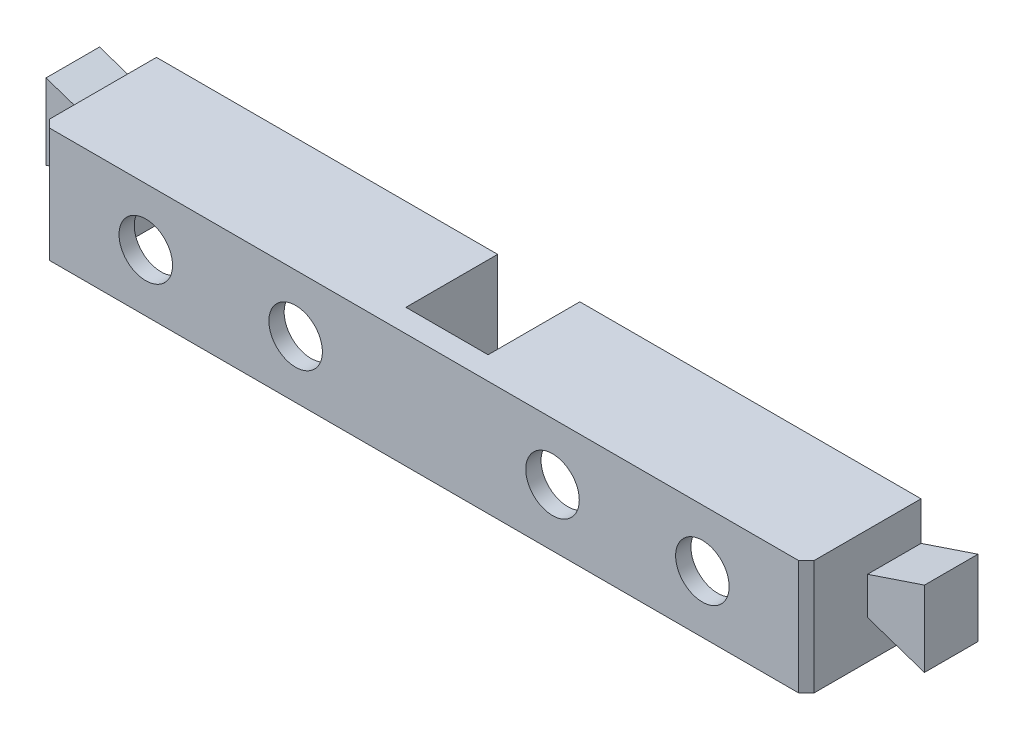
ISO-10303-21;
HEADER;
FILE_DESCRIPTION(('STEP AP214'),'2;1');
FILE_NAME('part.step','',(''),(''),'','','');
FILE_SCHEMA(('AUTOMOTIVE_DESIGN { 1 0 10303 214 1 1 1 1 }'));
ENDSEC;
DATA;
#1=APPLICATION_CONTEXT('core data for automotive mechanical design processes');
#2=APPLICATION_PROTOCOL_DEFINITION('international standard','automotive_design',2000,#1);
#3=PRODUCT_CONTEXT('',#1,'mechanical');
#4=PRODUCT('Part','Part','',(#3));
#5=PRODUCT_RELATED_PRODUCT_CATEGORY('part','',(#4));
#6=PRODUCT_DEFINITION_FORMATION('','',#4);
#7=PRODUCT_DEFINITION_CONTEXT('part definition',#1,'design');
#8=PRODUCT_DEFINITION('design','',#6,#7);
#9=PRODUCT_DEFINITION_SHAPE('','',#8);
#10=(LENGTH_UNIT() NAMED_UNIT(*) SI_UNIT(.MILLI.,.METRE.));
#11=(NAMED_UNIT(*) PLANE_ANGLE_UNIT() SI_UNIT($,.RADIAN.));
#12=(NAMED_UNIT(*) SI_UNIT($,.STERADIAN.) SOLID_ANGLE_UNIT());
#13=UNCERTAINTY_MEASURE_WITH_UNIT(LENGTH_MEASURE(1.E-05),#10,'distance_accuracy_value','');
#14=(GEOMETRIC_REPRESENTATION_CONTEXT(3) GLOBAL_UNCERTAINTY_ASSIGNED_CONTEXT((#13)) GLOBAL_UNIT_ASSIGNED_CONTEXT((#10,
#11,#12)) REPRESENTATION_CONTEXT('',''));
#15=CARTESIAN_POINT('',(0.,0.,0.));
#16=DIRECTION('',(0.,0.,1.));
#17=DIRECTION('',(1.,0.,0.));
#18=AXIS2_PLACEMENT_3D('',#15,#16,#17);
#19=CARTESIAN_POINT('',(-46.,5.5,13.));
#20=DIRECTION('',(0.,0.,1.));
#21=DIRECTION('',(1.,0.,0.));
#22=AXIS2_PLACEMENT_3D('',#19,#20,#21);
#23=PLANE('',#22);
#24=CARTESIAN_POINT('',(36.4,0.,13.));
#25=DIRECTION('',(0.,0.,1.));
#26=DIRECTION('',(1.,0.,0.));
#27=AXIS2_PLACEMENT_3D('',#24,#25,#26);
#28=CIRCLE('',#27,3.49999999999999);
#29=CARTESIAN_POINT('',(39.9,0.,13.));
#30=VERTEX_POINT('',#29);
#31=EDGE_CURVE('E356',#30,#30,#28,.T.);
#32=ORIENTED_EDGE('',*,*,#31,.T.);
#33=EDGE_LOOP('',(#32));
#34=FACE_BOUND('',#33,.T.);
#35=CARTESIAN_POINT('',(16.8,0.,13.));
#36=DIRECTION('',(0.,0.,1.));
#37=DIRECTION('',(1.,0.,0.));
#38=AXIS2_PLACEMENT_3D('',#35,#36,#37);
#39=CIRCLE('',#38,3.5);
#40=CARTESIAN_POINT('',(20.3,0.,13.));
#41=VERTEX_POINT('',#40);
#42=EDGE_CURVE('E525',#41,#41,#39,.T.);
#43=ORIENTED_EDGE('',*,*,#42,.T.);
#44=EDGE_LOOP('',(#43));
#45=FACE_BOUND('',#44,.T.);
#46=DIRECTION('',(0.,-1.,0.));
#47=VECTOR('',#46,1.);
#48=CARTESIAN_POINT('',(7.375,5.5,13.));
#49=LINE('',#48,#47);
#50=CARTESIAN_POINT('',(7.37500000000001,5.5,13.));
#51=VERTEX_POINT('',#50);
#52=CARTESIAN_POINT('',(7.375,0.499999999999999,13.));
#53=VERTEX_POINT('',#52);
#54=EDGE_CURVE('E63',#51,#53,#49,.T.);
#55=ORIENTED_EDGE('',*,*,#54,.F.);
#56=DIRECTION('',(-1.,0.,0.));
#57=VECTOR('',#56,1.);
#58=CARTESIAN_POINT('',(-46.,5.5,13.));
#59=LINE('',#58,#57);
#60=CARTESIAN_POINT('',(46.,5.5,13.));
#61=VERTEX_POINT('',#60);
#62=EDGE_CURVE('E344',#61,#51,#59,.T.);
#63=ORIENTED_EDGE('',*,*,#62,.F.);
#64=DIRECTION('',(0.,-1.,0.));
#65=VECTOR('',#64,1.);
#66=CARTESIAN_POINT('',(46.,5.5,13.));
#67=LINE('',#66,#65);
#68=CARTESIAN_POINT('',(46.,-7.5,13.));
#69=VERTEX_POINT('',#68);
#70=EDGE_CURVE('E373',#61,#69,#67,.T.);
#71=ORIENTED_EDGE('',*,*,#70,.T.);
#72=DIRECTION('',(-1.,0.,0.));
#73=VECTOR('',#72,1.);
#74=CARTESIAN_POINT('',(-46.,-7.5,13.));
#75=LINE('',#74,#73);
#76=CARTESIAN_POINT('',(5.375,-7.5,13.));
#77=VERTEX_POINT('',#76);
#78=EDGE_CURVE('E357',#69,#77,#75,.T.);
#79=ORIENTED_EDGE('',*,*,#78,.T.);
#80=DIRECTION('',(0.,-1.,0.));
#81=VECTOR('',#80,1.);
#82=CARTESIAN_POINT('',(5.375,5.5,13.));
#83=LINE('',#82,#81);
#84=CARTESIAN_POINT('',(5.375,0.500000000000001,13.));
#85=VERTEX_POINT('',#84);
#86=EDGE_CURVE('E272',#85,#77,#83,.T.);
#87=ORIENTED_EDGE('',*,*,#86,.F.);
#88=DIRECTION('',(-1.,0.,0.));
#89=VECTOR('',#88,1.);
#90=CARTESIAN_POINT('',(5.375,0.5,13.));
#91=LINE('',#90,#89);
#92=EDGE_CURVE('E58',#53,#85,#91,.T.);
#93=ORIENTED_EDGE('',*,*,#92,.F.);
#94=EDGE_LOOP('',(#55,#63,#71,#79,#87,#93));
#95=FACE_BOUND('',#94,.T.);
#96=ADVANCED_FACE('F41',(#34,#45,#95),#23,.F.);
#97=CARTESIAN_POINT('',(0.,5.5,0.));
#98=DIRECTION('',(0.,1.,0.));
#99=DIRECTION('',(0.,0.,1.));
#100=AXIS2_PLACEMENT_3D('',#97,#98,#99);
#101=PLANE('',#100);
#102=DIRECTION('',(0.,0.,1.));
#103=VECTOR('',#102,1.);
#104=CARTESIAN_POINT('',(7.375,5.5,-5.3851648071345));
#105=LINE('',#104,#103);
#106=CARTESIAN_POINT('',(7.37500000000001,5.5,0.));
#107=VERTEX_POINT('',#106);
#108=EDGE_CURVE('E258',#107,#51,#105,.T.);
#109=ORIENTED_EDGE('',*,*,#108,.F.);
#110=DIRECTION('',(1.,0.,0.));
#111=VECTOR('',#110,1.);
#112=CARTESIAN_POINT('',(46.,5.5,0.));
#113=LINE('',#112,#111);
#114=CARTESIAN_POINT('',(46.,5.5,0.));
#115=VERTEX_POINT('',#114);
#116=EDGE_CURVE('E247',#107,#115,#113,.T.);
#117=ORIENTED_EDGE('',*,*,#116,.T.);
#118=DIRECTION('',(0.,0.,1.));
#119=VECTOR('',#118,1.);
#120=CARTESIAN_POINT('',(46.,5.5,13.));
#121=LINE('',#120,#119);
#122=EDGE_CURVE('E339',#115,#61,#121,.T.);
#123=ORIENTED_EDGE('',*,*,#122,.T.);
#124=ORIENTED_EDGE('',*,*,#62,.T.);
#125=EDGE_LOOP('',(#109,#117,#123,#124));
#126=FACE_BOUND('',#125,.T.);
#127=ADVANCED_FACE('F553',(#126),#101,.F.);
#128=CARTESIAN_POINT('',(5.375,5.5,-4.86898040783733));
#129=DIRECTION('',(-1.,0.,0.));
#130=DIRECTION('',(0.,0.,1.));
#131=AXIS2_PLACEMENT_3D('',#128,#129,#130);
#132=PLANE('',#131);
#133=DIRECTION('',(0.,0.,-1.));
#134=VECTOR('',#133,1.);
#135=CARTESIAN_POINT('',(5.375,0.5,-4.86898040783733));
#136=LINE('',#135,#134);
#137=CARTESIAN_POINT('',(5.375,0.5,12.));
#138=VERTEX_POINT('',#137);
#139=EDGE_CURVE('E11',#85,#138,#136,.T.);
#140=ORIENTED_EDGE('',*,*,#139,.F.);
#141=ORIENTED_EDGE('',*,*,#86,.T.);
#142=DIRECTION('',(0.,0.,1.));
#143=VECTOR('',#142,1.);
#144=CARTESIAN_POINT('',(5.375,-7.5,-4.86898040783733));
#145=LINE('',#144,#143);
#146=CARTESIAN_POINT('',(5.375,-7.5,12.));
#147=VERTEX_POINT('',#146);
#148=EDGE_CURVE('E287',#147,#77,#145,.T.);
#149=ORIENTED_EDGE('',*,*,#148,.F.);
#150=DIRECTION('',(0.,1.,0.));
#151=VECTOR('',#150,1.);
#152=CARTESIAN_POINT('',(5.375,5.5,12.));
#153=LINE('',#152,#151);
#154=EDGE_CURVE('E286',#147,#138,#153,.T.);
#155=ORIENTED_EDGE('',*,*,#154,.T.);
#156=EDGE_LOOP('',(#140,#141,#149,#155));
#157=FACE_BOUND('',#156,.T.);
#158=ADVANCED_FACE('F560',(#157),#132,.F.);
#159=CARTESIAN_POINT('',(-36.4,0.,13.));
#160=DIRECTION('',(0.,0.,1.));
#161=DIRECTION('',(1.,0.,0.));
#162=AXIS2_PLACEMENT_3D('',#159,#160,#161);
#163=CIRCLE('',#162,3.5);
#164=CARTESIAN_POINT('',(-32.9,0.,13.));
#165=VERTEX_POINT('',#164);
#166=EDGE_CURVE('E521',#165,#165,#163,.T.);
#167=ORIENTED_EDGE('',*,*,#166,.T.);
#168=EDGE_LOOP('',(#167));
#169=FACE_BOUND('',#168,.T.);
#170=CARTESIAN_POINT('',(-16.8,0.,13.));
#171=DIRECTION('',(0.,0.,1.));
#172=DIRECTION('',(1.,0.,0.));
#173=AXIS2_PLACEMENT_3D('',#170,#171,#172);
#174=CIRCLE('',#173,3.5);
#175=CARTESIAN_POINT('',(-13.3,0.,13.));
#176=VERTEX_POINT('',#175);
#177=EDGE_CURVE('E335',#176,#176,#174,.T.);
#178=ORIENTED_EDGE('',*,*,#177,.T.);
#179=EDGE_LOOP('',(#178));
#180=FACE_BOUND('',#179,.T.);
#181=DIRECTION('',(0.,1.,0.));
#182=VECTOR('',#181,1.);
#183=CARTESIAN_POINT('',(-7.375,5.5,13.));
#184=LINE('',#183,#182);
#185=CARTESIAN_POINT('',(-7.37499999999999,-7.5,13.));
#186=VERTEX_POINT('',#185);
#187=CARTESIAN_POINT('',(-7.375,5.5,13.));
#188=VERTEX_POINT('',#187);
#189=EDGE_CURVE('E263',#186,#188,#184,.T.);
#190=ORIENTED_EDGE('',*,*,#189,.F.);
#191=CARTESIAN_POINT('',(-46.,-7.5,13.));
#192=VERTEX_POINT('',#191);
#193=EDGE_CURVE('E355',#186,#192,#75,.T.);
#194=ORIENTED_EDGE('',*,*,#193,.T.);
#195=DIRECTION('',(0.,-1.,0.));
#196=VECTOR('',#195,1.);
#197=CARTESIAN_POINT('',(-46.,5.5,13.));
#198=LINE('',#197,#196);
#199=CARTESIAN_POINT('',(-46.,5.5,13.));
#200=VERTEX_POINT('',#199);
#201=EDGE_CURVE('E369',#200,#192,#198,.T.);
#202=ORIENTED_EDGE('',*,*,#201,.F.);
#203=EDGE_CURVE('E343',#188,#200,#59,.T.);
#204=ORIENTED_EDGE('',*,*,#203,.F.);
#205=EDGE_LOOP('',(#190,#194,#202,#204));
#206=FACE_BOUND('',#205,.T.);
#207=ADVANCED_FACE('F555',(#169,#180,#206),#23,.F.);
#208=DIRECTION('',(0.,0.,1.));
#209=VECTOR('',#208,1.);
#210=CARTESIAN_POINT('',(-7.375,5.5,-13.1529464379659));
#211=LINE('',#210,#209);
#212=CARTESIAN_POINT('',(-7.37499999999999,5.5,0.));
#213=VERTEX_POINT('',#212);
#214=EDGE_CURVE('E267',#213,#188,#211,.T.);
#215=ORIENTED_EDGE('',*,*,#214,.T.);
#216=ORIENTED_EDGE('',*,*,#203,.T.);
#217=DIRECTION('',(0.,0.,-1.));
#218=VECTOR('',#217,1.);
#219=CARTESIAN_POINT('',(-46.,5.5,0.));
#220=LINE('',#219,#218);
#221=CARTESIAN_POINT('',(-46.,5.5,0.));
#222=VERTEX_POINT('',#221);
#223=EDGE_CURVE('E347',#200,#222,#220,.T.);
#224=ORIENTED_EDGE('',*,*,#223,.T.);
#225=EDGE_CURVE('E336',#222,#213,#113,.T.);
#226=ORIENTED_EDGE('',*,*,#225,.T.);
#227=EDGE_LOOP('',(#215,#216,#224,#226));
#228=FACE_BOUND('',#227,.T.);
#229=ADVANCED_FACE('F563',(#228),#101,.F.);
#230=CARTESIAN_POINT('',(0.,0.,0.));
#231=DIRECTION('',(0.,0.,-1.));
#232=DIRECTION('',(-1.,0.,0.));
#233=AXIS2_PLACEMENT_3D('',#230,#231,#232);
#234=PLANE('',#233);
#235=DIRECTION('',(0.,1.,0.));
#236=VECTOR('',#235,1.);
#237=CARTESIAN_POINT('',(5.375,-2.5,0.));
#238=LINE('',#237,#236);
#239=CARTESIAN_POINT('',(5.375,0.5,0.));
#240=VERTEX_POINT('',#239);
#241=CARTESIAN_POINT('',(5.375,7.5,0.));
#242=VERTEX_POINT('',#241);
#243=EDGE_CURVE('E307',#240,#242,#238,.T.);
#244=ORIENTED_EDGE('',*,*,#243,.T.);
#245=DIRECTION('',(-1.,0.,0.));
#246=VECTOR('',#245,1.);
#247=CARTESIAN_POINT('',(-50.,7.5,0.));
#248=LINE('',#247,#246);
#249=CARTESIAN_POINT('',(50.,7.5,0.));
#250=VERTEX_POINT('',#249);
#251=EDGE_CURVE('E467',#250,#242,#248,.T.);
#252=ORIENTED_EDGE('',*,*,#251,.F.);
#253=DIRECTION('',(0.,1.,0.));
#254=VECTOR('',#253,1.);
#255=CARTESIAN_POINT('',(50.,-7.5,0.));
#256=LINE('',#255,#254);
#257=CARTESIAN_POINT('',(50.,2.45000000000001,0.));
#258=VERTEX_POINT('',#257);
#259=EDGE_CURVE('E451',#258,#250,#256,.T.);
#260=ORIENTED_EDGE('',*,*,#259,.F.);
#261=DIRECTION('',(-0.948045105831673,-0.318135941554253,0.));
#262=VECTOR('',#261,1.);
#263=CARTESIAN_POINT('',(50.,2.45000000000001,0.));
#264=LINE('',#263,#262);
#265=CARTESIAN_POINT('',(57.45,4.95000000000001,0.));
#266=VERTEX_POINT('',#265);
#267=EDGE_CURVE('E382',#266,#258,#264,.T.);
#268=ORIENTED_EDGE('',*,*,#267,.F.);
#269=DIRECTION('',(0.,1.,0.));
#270=VECTOR('',#269,1.);
#271=CARTESIAN_POINT('',(57.45,4.95000000000001,0.));
#272=LINE('',#271,#270);
#273=CARTESIAN_POINT('',(57.45,-4.94999999999999,0.));
#274=VERTEX_POINT('',#273);
#275=EDGE_CURVE('E395',#274,#266,#272,.T.);
#276=ORIENTED_EDGE('',*,*,#275,.F.);
#277=DIRECTION('',(0.948045105831674,-0.318135941554253,0.));
#278=VECTOR('',#277,1.);
#279=CARTESIAN_POINT('',(57.45,-4.94999999999999,0.));
#280=LINE('',#279,#278);
#281=CARTESIAN_POINT('',(50.,-2.44999999999999,0.));
#282=VERTEX_POINT('',#281);
#283=EDGE_CURVE('E368',#282,#274,#280,.T.);
#284=ORIENTED_EDGE('',*,*,#283,.F.);
#285=CARTESIAN_POINT('',(50.,-7.5,0.));
#286=VERTEX_POINT('',#285);
#287=EDGE_CURVE('E462',#286,#282,#256,.T.);
#288=ORIENTED_EDGE('',*,*,#287,.F.);
#289=DIRECTION('',(1.,0.,0.));
#290=VECTOR('',#289,1.);
#291=CARTESIAN_POINT('',(-50.,-7.5,0.));
#292=LINE('',#291,#290);
#293=CARTESIAN_POINT('',(46.,-7.5,0.));
#294=VERTEX_POINT('',#293);
#295=EDGE_CURVE('E476',#294,#286,#292,.T.);
#296=ORIENTED_EDGE('',*,*,#295,.F.);
#297=DIRECTION('',(0.,-1.,0.));
#298=VECTOR('',#297,1.);
#299=CARTESIAN_POINT('',(46.,5.5,0.));
#300=LINE('',#299,#298);
#301=EDGE_CURVE('E350',#115,#294,#300,.T.);
#302=ORIENTED_EDGE('',*,*,#301,.F.);
#303=ORIENTED_EDGE('',*,*,#116,.F.);
#304=DIRECTION('',(0.,-1.,0.));
#305=VECTOR('',#304,1.);
#306=CARTESIAN_POINT('',(7.375,5.5,0.));
#307=LINE('',#306,#305);
#308=CARTESIAN_POINT('',(7.375,0.5,0.));
#309=VERTEX_POINT('',#308);
#310=EDGE_CURVE('E230',#107,#309,#307,.T.);
#311=ORIENTED_EDGE('',*,*,#310,.T.);
#312=DIRECTION('',(-1.,0.,0.));
#313=VECTOR('',#312,1.);
#314=CARTESIAN_POINT('',(5.375,0.5,0.));
#315=LINE('',#314,#313);
#316=EDGE_CURVE('E236',#309,#240,#315,.T.);
#317=ORIENTED_EDGE('',*,*,#316,.T.);
#318=EDGE_LOOP('',(#244,#252,#260,#268,#276,#284,#288,#296,#302,#303,#311,#317));
#319=FACE_BOUND('',#318,.T.);
#320=ADVANCED_FACE('F245',(#319),#234,.T.);
#321=CARTESIAN_POINT('',(50.,-7.5,15.));
#322=DIRECTION('',(-1.,0.,0.));
#323=DIRECTION('',(0.,0.,1.));
#324=AXIS2_PLACEMENT_3D('',#321,#322,#323);
#325=PLANE('',#324);
#326=DIRECTION('',(0.,0.,-1.));
#327=VECTOR('',#326,1.);
#328=CARTESIAN_POINT('',(50.,7.5,15.));
#329=LINE('',#328,#327);
#330=CARTESIAN_POINT('',(50.,7.5,14.));
#331=VERTEX_POINT('',#330);
#332=EDGE_CURVE('E490',#331,#250,#329,.T.);
#333=ORIENTED_EDGE('',*,*,#332,.F.);
#334=DIRECTION('',(0.,-1.,0.));
#335=VECTOR('',#334,1.);
#336=CARTESIAN_POINT('',(50.,-7.5,14.));
#337=LINE('',#336,#335);
#338=CARTESIAN_POINT('',(50.,-7.5,14.));
#339=VERTEX_POINT('',#338);
#340=EDGE_CURVE('E51',#331,#339,#337,.T.);
#341=ORIENTED_EDGE('',*,*,#340,.T.);
#342=DIRECTION('',(0.,0.,-1.));
#343=VECTOR('',#342,1.);
#344=CARTESIAN_POINT('',(50.,-7.5,15.));
#345=LINE('',#344,#343);
#346=EDGE_CURVE('E461',#339,#286,#345,.T.);
#347=ORIENTED_EDGE('',*,*,#346,.T.);
#348=ORIENTED_EDGE('',*,*,#287,.T.);
#349=DIRECTION('',(0.,0.,-1.));
#350=VECTOR('',#349,1.);
#351=CARTESIAN_POINT('',(50.,-2.44999999999999,7.));
#352=LINE('',#351,#350);
#353=CARTESIAN_POINT('',(50.,-2.44999999999999,7.));
#354=VERTEX_POINT('',#353);
#355=EDGE_CURVE('E411',#354,#282,#352,.T.);
#356=ORIENTED_EDGE('',*,*,#355,.F.);
#357=DIRECTION('',(0.,-1.,0.));
#358=VECTOR('',#357,1.);
#359=CARTESIAN_POINT('',(50.,0.,7.));
#360=LINE('',#359,#358);
#361=CARTESIAN_POINT('',(50.,2.45000000000001,7.));
#362=VERTEX_POINT('',#361);
#363=EDGE_CURVE('E378',#362,#354,#360,.T.);
#364=ORIENTED_EDGE('',*,*,#363,.F.);
#365=DIRECTION('',(0.,0.,-1.));
#366=VECTOR('',#365,1.);
#367=CARTESIAN_POINT('',(50.,2.45000000000001,7.));
#368=LINE('',#367,#366);
#369=EDGE_CURVE('E391',#362,#258,#368,.T.);
#370=ORIENTED_EDGE('',*,*,#369,.T.);
#371=ORIENTED_EDGE('',*,*,#259,.T.);
#372=EDGE_LOOP('',(#333,#341,#347,#348,#356,#364,#370,#371));
#373=FACE_BOUND('',#372,.T.);
#374=ADVANCED_FACE('F665',(#373),#325,.F.);
#375=CARTESIAN_POINT('',(-50.,-7.5,15.));
#376=DIRECTION('',(1.,0.,0.));
#377=DIRECTION('',(0.,0.,-1.));
#378=AXIS2_PLACEMENT_3D('',#375,#376,#377);
#379=PLANE('',#378);
#380=DIRECTION('',(0.,0.,-1.));
#381=VECTOR('',#380,1.);
#382=CARTESIAN_POINT('',(-50.,-7.5,15.));
#383=LINE('',#382,#381);
#384=CARTESIAN_POINT('',(-50.,-7.5,14.));
#385=VERTEX_POINT('',#384);
#386=CARTESIAN_POINT('',(-50.,-7.5,0.));
#387=VERTEX_POINT('',#386);
#388=EDGE_CURVE('E483',#385,#387,#383,.T.);
#389=ORIENTED_EDGE('',*,*,#388,.F.);
#390=DIRECTION('',(0.,1.,0.));
#391=VECTOR('',#390,1.);
#392=CARTESIAN_POINT('',(-50.,-7.5,14.));
#393=LINE('',#392,#391);
#394=CARTESIAN_POINT('',(-50.,7.5,14.));
#395=VERTEX_POINT('',#394);
#396=EDGE_CURVE('E507',#385,#395,#393,.T.);
#397=ORIENTED_EDGE('',*,*,#396,.T.);
#398=DIRECTION('',(0.,0.,-1.));
#399=VECTOR('',#398,1.);
#400=CARTESIAN_POINT('',(-50.,7.5,15.));
#401=LINE('',#400,#399);
#402=CARTESIAN_POINT('',(-50.,7.5,0.));
#403=VERTEX_POINT('',#402);
#404=EDGE_CURVE('E486',#395,#403,#401,.T.);
#405=ORIENTED_EDGE('',*,*,#404,.T.);
#406=DIRECTION('',(0.,-1.,0.));
#407=VECTOR('',#406,1.);
#408=CARTESIAN_POINT('',(-50.,-7.5,0.));
#409=LINE('',#408,#407);
#410=CARTESIAN_POINT('',(-50.,2.45,0.));
#411=VERTEX_POINT('',#410);
#412=EDGE_CURVE('E472',#403,#411,#409,.T.);
#413=ORIENTED_EDGE('',*,*,#412,.T.);
#414=DIRECTION('',(0.,0.,-1.));
#415=VECTOR('',#414,1.);
#416=CARTESIAN_POINT('',(-50.,2.45,7.));
#417=LINE('',#416,#415);
#418=CARTESIAN_POINT('',(-50.,2.45,7.));
#419=VERTEX_POINT('',#418);
#420=EDGE_CURVE('E448',#419,#411,#417,.T.);
#421=ORIENTED_EDGE('',*,*,#420,.F.);
#422=DIRECTION('',(0.,1.,0.));
#423=VECTOR('',#422,1.);
#424=CARTESIAN_POINT('',(-50.,-2.45,7.));
#425=LINE('',#424,#423);
#426=CARTESIAN_POINT('',(-50.,-2.45,7.));
#427=VERTEX_POINT('',#426);
#428=EDGE_CURVE('E415',#427,#419,#425,.T.);
#429=ORIENTED_EDGE('',*,*,#428,.F.);
#430=DIRECTION('',(0.,0.,-1.));
#431=VECTOR('',#430,1.);
#432=CARTESIAN_POINT('',(-50.,-2.45,7.));
#433=LINE('',#432,#431);
#434=CARTESIAN_POINT('',(-50.,-2.45,0.));
#435=VERTEX_POINT('',#434);
#436=EDGE_CURVE('E428',#427,#435,#433,.T.);
#437=ORIENTED_EDGE('',*,*,#436,.T.);
#438=EDGE_CURVE('E471',#435,#387,#409,.T.);
#439=ORIENTED_EDGE('',*,*,#438,.T.);
#440=EDGE_LOOP('',(#389,#397,#405,#413,#421,#429,#437,#439));
#441=FACE_BOUND('',#440,.T.);
#442=ADVANCED_FACE('F631',(#441),#379,.F.);
#443=CARTESIAN_POINT('',(-50.,7.5,15.));
#444=DIRECTION('',(0.,-1.,0.));
#445=DIRECTION('',(0.,0.,-1.));
#446=AXIS2_PLACEMENT_3D('',#443,#444,#445);
#447=PLANE('',#446);
#448=ORIENTED_EDGE('',*,*,#251,.T.);
#449=DIRECTION('',(0.,0.,-1.));
#450=VECTOR('',#449,1.);
#451=CARTESIAN_POINT('',(5.375,7.5,12.));
#452=LINE('',#451,#450);
#453=CARTESIAN_POINT('',(5.375,7.5,12.));
#454=VERTEX_POINT('',#453);
#455=EDGE_CURVE('E291',#454,#242,#452,.T.);
#456=ORIENTED_EDGE('',*,*,#455,.F.);
#457=DIRECTION('',(1.,0.,0.));
#458=VECTOR('',#457,1.);
#459=CARTESIAN_POINT('',(-5.375,7.5,12.));
#460=LINE('',#459,#458);
#461=CARTESIAN_POINT('',(-5.375,7.5,12.));
#462=VERTEX_POINT('',#461);
#463=EDGE_CURVE('E303',#462,#454,#460,.T.);
#464=ORIENTED_EDGE('',*,*,#463,.F.);
#465=DIRECTION('',(0.,0.,1.));
#466=VECTOR('',#465,1.);
#467=CARTESIAN_POINT('',(-5.375,7.5,12.));
#468=LINE('',#467,#466);
#469=CARTESIAN_POINT('',(-5.375,7.5,0.));
#470=VERTEX_POINT('',#469);
#471=EDGE_CURVE('E299',#470,#462,#468,.T.);
#472=ORIENTED_EDGE('',*,*,#471,.F.);
#473=EDGE_CURVE('E466',#470,#403,#248,.T.);
#474=ORIENTED_EDGE('',*,*,#473,.T.);
#475=ORIENTED_EDGE('',*,*,#404,.F.);
#476=DIRECTION('',(-0.707106781186543,0.,-0.707106781186552));
#477=VECTOR('',#476,1.);
#478=CARTESIAN_POINT('',(-49.,7.5,15.));
#479=LINE('',#478,#477);
#480=CARTESIAN_POINT('',(-49.,7.5,15.));
#481=VERTEX_POINT('',#480);
#482=EDGE_CURVE('E513',#395,#481,#479,.F.);
#483=ORIENTED_EDGE('',*,*,#482,.T.);
#484=DIRECTION('',(-1.,0.,0.));
#485=VECTOR('',#484,1.);
#486=CARTESIAN_POINT('',(-50.,7.5,15.));
#487=LINE('',#486,#485);
#488=CARTESIAN_POINT('',(49.,7.5,15.));
#489=VERTEX_POINT('',#488);
#490=EDGE_CURVE('E452',#489,#481,#487,.T.);
#491=ORIENTED_EDGE('',*,*,#490,.F.);
#492=DIRECTION('',(-0.707106781186543,0.,0.707106781186552));
#493=VECTOR('',#492,1.);
#494=CARTESIAN_POINT('',(49.,7.5,15.));
#495=LINE('',#494,#493);
#496=EDGE_CURVE('E510',#489,#331,#495,.F.);
#497=ORIENTED_EDGE('',*,*,#496,.T.);
#498=ORIENTED_EDGE('',*,*,#332,.T.);
#499=EDGE_LOOP('',(#448,#456,#464,#472,#474,#475,#483,#491,#497,#498));
#500=FACE_BOUND('',#499,.T.);
#501=ADVANCED_FACE('F652',(#500),#447,.F.);
#502=CARTESIAN_POINT('',(-50.,-7.5,15.));
#503=DIRECTION('',(0.,1.,0.));
#504=DIRECTION('',(0.,0.,1.));
#505=AXIS2_PLACEMENT_3D('',#502,#503,#504);
#506=PLANE('',#505);
#507=ORIENTED_EDGE('',*,*,#193,.F.);
#508=DIRECTION('',(0.,0.,1.));
#509=VECTOR('',#508,1.);
#510=CARTESIAN_POINT('',(-7.375,-7.5,-13.1529464379659));
#511=LINE('',#510,#509);
#512=CARTESIAN_POINT('',(-7.375,-7.5,0.));
#513=VERTEX_POINT('',#512);
#514=EDGE_CURVE('E253',#513,#186,#511,.T.);
#515=ORIENTED_EDGE('',*,*,#514,.F.);
#516=DIRECTION('',(-1.,0.,0.));
#517=VECTOR('',#516,1.);
#518=CARTESIAN_POINT('',(-5.375,-7.5,0.));
#519=LINE('',#518,#517);
#520=CARTESIAN_POINT('',(-5.375,-7.5,0.));
#521=VERTEX_POINT('',#520);
#522=EDGE_CURVE('E273',#521,#513,#519,.T.);
#523=ORIENTED_EDGE('',*,*,#522,.F.);
#524=DIRECTION('',(0.,0.,1.));
#525=VECTOR('',#524,1.);
#526=CARTESIAN_POINT('',(-5.375,-7.5,-13.1529464379659));
#527=LINE('',#526,#525);
#528=CARTESIAN_POINT('',(-5.375,-7.5,12.));
#529=VERTEX_POINT('',#528);
#530=EDGE_CURVE('E249',#521,#529,#527,.T.);
#531=ORIENTED_EDGE('',*,*,#530,.T.);
#532=DIRECTION('',(1.,0.,0.));
#533=VECTOR('',#532,1.);
#534=CARTESIAN_POINT('',(5.375,-7.5,12.));
#535=LINE('',#534,#533);
#536=EDGE_CURVE('E282',#529,#147,#535,.T.);
#537=ORIENTED_EDGE('',*,*,#536,.T.);
#538=ORIENTED_EDGE('',*,*,#148,.T.);
#539=ORIENTED_EDGE('',*,*,#78,.F.);
#540=DIRECTION('',(0.,0.,1.));
#541=VECTOR('',#540,1.);
#542=CARTESIAN_POINT('',(46.,-7.5,13.));
#543=LINE('',#542,#541);
#544=EDGE_CURVE('E351',#294,#69,#543,.T.);
#545=ORIENTED_EDGE('',*,*,#544,.F.);
#546=ORIENTED_EDGE('',*,*,#295,.T.);
#547=ORIENTED_EDGE('',*,*,#346,.F.);
#548=DIRECTION('',(0.707106781186543,0.,-0.707106781186552));
#549=VECTOR('',#548,1.);
#550=CARTESIAN_POINT('',(49.,-7.5,15.));
#551=LINE('',#550,#549);
#552=CARTESIAN_POINT('',(49.,-7.5,15.));
#553=VERTEX_POINT('',#552);
#554=EDGE_CURVE('E501',#339,#553,#551,.F.);
#555=ORIENTED_EDGE('',*,*,#554,.T.);
#556=DIRECTION('',(1.,0.,0.));
#557=VECTOR('',#556,1.);
#558=CARTESIAN_POINT('',(-50.,-7.5,15.));
#559=LINE('',#558,#557);
#560=CARTESIAN_POINT('',(-49.,-7.5,15.));
#561=VERTEX_POINT('',#560);
#562=EDGE_CURVE('E456',#561,#553,#559,.T.);
#563=ORIENTED_EDGE('',*,*,#562,.F.);
#564=DIRECTION('',(0.707106781186543,0.,0.707106781186552));
#565=VECTOR('',#564,1.);
#566=CARTESIAN_POINT('',(-49.,-7.5,15.));
#567=LINE('',#566,#565);
#568=EDGE_CURVE('E504',#561,#385,#567,.F.);
#569=ORIENTED_EDGE('',*,*,#568,.T.);
#570=ORIENTED_EDGE('',*,*,#388,.T.);
#571=CARTESIAN_POINT('',(-46.,-7.5,0.));
#572=VERTEX_POINT('',#571);
#573=EDGE_CURVE('E457',#387,#572,#292,.T.);
#574=ORIENTED_EDGE('',*,*,#573,.T.);
#575=DIRECTION('',(0.,0.,-1.));
#576=VECTOR('',#575,1.);
#577=CARTESIAN_POINT('',(-46.,-7.5,0.));
#578=LINE('',#577,#576);
#579=EDGE_CURVE('E361',#192,#572,#578,.T.);
#580=ORIENTED_EDGE('',*,*,#579,.F.);
#581=EDGE_LOOP('',(#507,#515,#523,#531,#537,#538,#539,#545,#546,#547,#555,#563,#569,#570,#574,#580));
#582=FACE_BOUND('',#581,.T.);
#583=ADVANCED_FACE('F588',(#582),#506,.F.);
#584=CARTESIAN_POINT('',(0.,0.,15.));
#585=DIRECTION('',(0.,0.,-1.));
#586=DIRECTION('',(-1.,0.,0.));
#587=AXIS2_PLACEMENT_3D('',#584,#585,#586);
#588=PLANE('',#587);
#589=CARTESIAN_POINT('',(36.4,0.,15.));
#590=DIRECTION('',(0.,0.,1.));
#591=DIRECTION('',(1.,0.,0.));
#592=AXIS2_PLACEMENT_3D('',#589,#590,#591);
#593=CIRCLE('',#592,3.49999999999999);
#594=CARTESIAN_POINT('',(39.9,0.,15.));
#595=VERTEX_POINT('',#594);
#596=EDGE_CURVE('E311',#595,#595,#593,.T.);
#597=ORIENTED_EDGE('',*,*,#596,.F.);
#598=EDGE_LOOP('',(#597));
#599=FACE_BOUND('',#598,.T.);
#600=CARTESIAN_POINT('',(16.8,0.,15.));
#601=DIRECTION('',(0.,0.,1.));
#602=DIRECTION('',(1.,0.,0.));
#603=AXIS2_PLACEMENT_3D('',#600,#601,#602);
#604=CIRCLE('',#603,3.5);
#605=CARTESIAN_POINT('',(20.3,0.,15.));
#606=VERTEX_POINT('',#605);
#607=EDGE_CURVE('E325',#606,#606,#604,.T.);
#608=ORIENTED_EDGE('',*,*,#607,.F.);
#609=EDGE_LOOP('',(#608));
#610=FACE_BOUND('',#609,.T.);
#611=CARTESIAN_POINT('',(-36.4,0.,15.));
#612=DIRECTION('',(0.,0.,1.));
#613=DIRECTION('',(1.,0.,0.));
#614=AXIS2_PLACEMENT_3D('',#611,#612,#613);
#615=CIRCLE('',#614,3.5);
#616=CARTESIAN_POINT('',(-32.9,0.,15.));
#617=VERTEX_POINT('',#616);
#618=EDGE_CURVE('E320',#617,#617,#615,.T.);
#619=ORIENTED_EDGE('',*,*,#618,.F.);
#620=EDGE_LOOP('',(#619));
#621=FACE_BOUND('',#620,.T.);
#622=CARTESIAN_POINT('',(-16.8,0.,15.));
#623=DIRECTION('',(0.,0.,1.));
#624=DIRECTION('',(1.,0.,0.));
#625=AXIS2_PLACEMENT_3D('',#622,#623,#624);
#626=CIRCLE('',#625,3.5);
#627=CARTESIAN_POINT('',(-13.3,0.,15.));
#628=VERTEX_POINT('',#627);
#629=EDGE_CURVE('E324',#628,#628,#626,.T.);
#630=ORIENTED_EDGE('',*,*,#629,.F.);
#631=EDGE_LOOP('',(#630));
#632=FACE_BOUND('',#631,.T.);
#633=ORIENTED_EDGE('',*,*,#490,.T.);
#634=DIRECTION('',(0.,-1.,0.));
#635=VECTOR('',#634,1.);
#636=CARTESIAN_POINT('',(-49.,0.,15.));
#637=LINE('',#636,#635);
#638=EDGE_CURVE('E497',#481,#561,#637,.T.);
#639=ORIENTED_EDGE('',*,*,#638,.T.);
#640=ORIENTED_EDGE('',*,*,#562,.T.);
#641=DIRECTION('',(0.,1.,0.));
#642=VECTOR('',#641,1.);
#643=CARTESIAN_POINT('',(49.,0.,15.));
#644=LINE('',#643,#642);
#645=EDGE_CURVE('E493',#553,#489,#644,.T.);
#646=ORIENTED_EDGE('',*,*,#645,.T.);
#647=EDGE_LOOP('',(#633,#639,#640,#646));
#648=FACE_BOUND('',#647,.T.);
#649=ADVANCED_FACE('F658',(#599,#610,#621,#632,#648),#588,.F.);
#650=DIRECTION('',(0.,1.,0.));
#651=VECTOR('',#650,1.);
#652=CARTESIAN_POINT('',(-5.375,-2.5,0.));
#653=LINE('',#652,#651);
#654=EDGE_CURVE('E315',#521,#470,#653,.T.);
#655=ORIENTED_EDGE('',*,*,#654,.F.);
#656=ORIENTED_EDGE('',*,*,#522,.T.);
#657=DIRECTION('',(0.,1.,0.));
#658=VECTOR('',#657,1.);
#659=CARTESIAN_POINT('',(-7.375,5.5,0.));
#660=LINE('',#659,#658);
#661=EDGE_CURVE('E268',#513,#213,#660,.T.);
#662=ORIENTED_EDGE('',*,*,#661,.T.);
#663=ORIENTED_EDGE('',*,*,#225,.F.);
#664=DIRECTION('',(0.,-1.,0.));
#665=VECTOR('',#664,1.);
#666=CARTESIAN_POINT('',(-46.,5.5,0.));
#667=LINE('',#666,#665);
#668=EDGE_CURVE('E364',#222,#572,#667,.T.);
#669=ORIENTED_EDGE('',*,*,#668,.T.);
#670=ORIENTED_EDGE('',*,*,#573,.F.);
#671=ORIENTED_EDGE('',*,*,#438,.F.);
#672=DIRECTION('',(0.948045105831673,0.318135941554253,0.));
#673=VECTOR('',#672,1.);
#674=CARTESIAN_POINT('',(-57.45,-4.95,0.));
#675=LINE('',#674,#673);
#676=CARTESIAN_POINT('',(-57.45,-4.95,0.));
#677=VERTEX_POINT('',#676);
#678=EDGE_CURVE('E419',#677,#435,#675,.T.);
#679=ORIENTED_EDGE('',*,*,#678,.F.);
#680=DIRECTION('',(0.,-1.,0.));
#681=VECTOR('',#680,1.);
#682=CARTESIAN_POINT('',(-57.45,0.,0.));
#683=LINE('',#682,#681);
#684=CARTESIAN_POINT('',(-57.45,4.95,0.));
#685=VERTEX_POINT('',#684);
#686=EDGE_CURVE('E432',#685,#677,#683,.T.);
#687=ORIENTED_EDGE('',*,*,#686,.F.);
#688=DIRECTION('',(-0.948045105831674,0.318135941554253,0.));
#689=VECTOR('',#688,1.);
#690=CARTESIAN_POINT('',(-50.,2.45,0.));
#691=LINE('',#690,#689);
#692=EDGE_CURVE('E414',#411,#685,#691,.T.);
#693=ORIENTED_EDGE('',*,*,#692,.F.);
#694=ORIENTED_EDGE('',*,*,#412,.F.);
#695=ORIENTED_EDGE('',*,*,#473,.F.);
#696=EDGE_LOOP('',(#655,#656,#662,#663,#669,#670,#671,#679,#687,#693,#694,#695));
#697=FACE_BOUND('',#696,.T.);
#698=ADVANCED_FACE('F594',(#697),#234,.T.);
#699=CARTESIAN_POINT('',(-50.,2.45,7.));
#700=DIRECTION('',(-0.318135941554253,-0.948045105831673,0.));
#701=DIRECTION('',(0.948045105831674,-0.318135941554253,0.));
#702=AXIS2_PLACEMENT_3D('',#699,#700,#701);
#703=PLANE('',#702);
#704=ORIENTED_EDGE('',*,*,#692,.T.);
#705=DIRECTION('',(0.,0.,-1.));
#706=VECTOR('',#705,1.);
#707=CARTESIAN_POINT('',(-57.45,4.95,7.));
#708=LINE('',#707,#706);
#709=CARTESIAN_POINT('',(-57.45,4.95,7.));
#710=VERTEX_POINT('',#709);
#711=EDGE_CURVE('E444',#710,#685,#708,.T.);
#712=ORIENTED_EDGE('',*,*,#711,.F.);
#713=DIRECTION('',(-0.948045105831674,0.318135941554253,0.));
#714=VECTOR('',#713,1.);
#715=CARTESIAN_POINT('',(-50.,2.45,7.));
#716=LINE('',#715,#714);
#717=EDGE_CURVE('E418',#419,#710,#716,.T.);
#718=ORIENTED_EDGE('',*,*,#717,.F.);
#719=ORIENTED_EDGE('',*,*,#420,.T.);
#720=EDGE_LOOP('',(#704,#712,#718,#719));
#721=FACE_BOUND('',#720,.T.);
#722=ADVANCED_FACE('F646',(#721),#703,.F.);
#723=CARTESIAN_POINT('',(-57.45,0.,7.));
#724=DIRECTION('',(1.,0.,0.));
#725=DIRECTION('',(0.,0.,-1.));
#726=AXIS2_PLACEMENT_3D('',#723,#724,#725);
#727=PLANE('',#726);
#728=ORIENTED_EDGE('',*,*,#686,.T.);
#729=DIRECTION('',(0.,0.,-1.));
#730=VECTOR('',#729,1.);
#731=CARTESIAN_POINT('',(-57.45,-4.95,7.));
#732=LINE('',#731,#730);
#733=CARTESIAN_POINT('',(-57.45,-4.95,7.));
#734=VERTEX_POINT('',#733);
#735=EDGE_CURVE('E440',#734,#677,#732,.T.);
#736=ORIENTED_EDGE('',*,*,#735,.F.);
#737=DIRECTION('',(0.,-1.,0.));
#738=VECTOR('',#737,1.);
#739=CARTESIAN_POINT('',(-57.45,4.95,7.));
#740=LINE('',#739,#738);
#741=EDGE_CURVE('E422',#710,#734,#740,.T.);
#742=ORIENTED_EDGE('',*,*,#741,.F.);
#743=ORIENTED_EDGE('',*,*,#711,.T.);
#744=EDGE_LOOP('',(#728,#736,#742,#743));
#745=FACE_BOUND('',#744,.T.);
#746=ADVANCED_FACE('F642',(#745),#727,.F.);
#747=CARTESIAN_POINT('',(-57.45,-4.95,7.));
#748=DIRECTION('',(-0.318135941554253,0.948045105831673,0.));
#749=DIRECTION('',(-0.948045105831674,-0.318135941554253,0.));
#750=AXIS2_PLACEMENT_3D('',#747,#748,#749);
#751=PLANE('',#750);
#752=ORIENTED_EDGE('',*,*,#678,.T.);
#753=ORIENTED_EDGE('',*,*,#436,.F.);
#754=DIRECTION('',(0.948045105831673,0.318135941554253,0.));
#755=VECTOR('',#754,1.);
#756=CARTESIAN_POINT('',(-57.45,-4.95,7.));
#757=LINE('',#756,#755);
#758=EDGE_CURVE('E425',#734,#427,#757,.T.);
#759=ORIENTED_EDGE('',*,*,#758,.F.);
#760=ORIENTED_EDGE('',*,*,#735,.T.);
#761=EDGE_LOOP('',(#752,#753,#759,#760));
#762=FACE_BOUND('',#761,.T.);
#763=ADVANCED_FACE('F637',(#762),#751,.F.);
#764=CARTESIAN_POINT('',(0.,0.,7.));
#765=DIRECTION('',(0.,0.,1.));
#766=DIRECTION('',(1.,0.,0.));
#767=AXIS2_PLACEMENT_3D('',#764,#765,#766);
#768=PLANE('',#767);
#769=ORIENTED_EDGE('',*,*,#428,.T.);
#770=ORIENTED_EDGE('',*,*,#717,.T.);
#771=ORIENTED_EDGE('',*,*,#741,.T.);
#772=ORIENTED_EDGE('',*,*,#758,.T.);
#773=EDGE_LOOP('',(#769,#770,#771,#772));
#774=FACE_BOUND('',#773,.T.);
#775=ADVANCED_FACE('F698',(#774),#768,.T.);
#776=CARTESIAN_POINT('',(57.45,-4.94999999999999,7.));
#777=DIRECTION('',(0.318135941554253,0.948045105831673,0.));
#778=DIRECTION('',(-0.948045105831674,0.318135941554253,0.));
#779=AXIS2_PLACEMENT_3D('',#776,#777,#778);
#780=PLANE('',#779);
#781=ORIENTED_EDGE('',*,*,#283,.T.);
#782=DIRECTION('',(0.,0.,-1.));
#783=VECTOR('',#782,1.);
#784=CARTESIAN_POINT('',(57.45,-4.94999999999999,7.));
#785=LINE('',#784,#783);
#786=CARTESIAN_POINT('',(57.45,-4.94999999999999,7.));
#787=VERTEX_POINT('',#786);
#788=EDGE_CURVE('E407',#787,#274,#785,.T.);
#789=ORIENTED_EDGE('',*,*,#788,.F.);
#790=DIRECTION('',(0.948045105831674,-0.318135941554253,0.));
#791=VECTOR('',#790,1.);
#792=CARTESIAN_POINT('',(57.45,-4.94999999999999,7.));
#793=LINE('',#792,#791);
#794=EDGE_CURVE('E381',#354,#787,#793,.T.);
#795=ORIENTED_EDGE('',*,*,#794,.F.);
#796=ORIENTED_EDGE('',*,*,#355,.T.);
#797=EDGE_LOOP('',(#781,#789,#795,#796));
#798=FACE_BOUND('',#797,.T.);
#799=ADVANCED_FACE('F682',(#798),#780,.F.);
#800=CARTESIAN_POINT('',(57.45,4.95000000000001,7.));
#801=DIRECTION('',(-1.,0.,0.));
#802=DIRECTION('',(0.,0.,1.));
#803=AXIS2_PLACEMENT_3D('',#800,#801,#802);
#804=PLANE('',#803);
#805=ORIENTED_EDGE('',*,*,#275,.T.);
#806=DIRECTION('',(0.,0.,-1.));
#807=VECTOR('',#806,1.);
#808=CARTESIAN_POINT('',(57.45,4.95000000000001,7.));
#809=LINE('',#808,#807);
#810=CARTESIAN_POINT('',(57.45,4.95000000000001,7.));
#811=VERTEX_POINT('',#810);
#812=EDGE_CURVE('E403',#811,#266,#809,.T.);
#813=ORIENTED_EDGE('',*,*,#812,.F.);
#814=DIRECTION('',(0.,1.,0.));
#815=VECTOR('',#814,1.);
#816=CARTESIAN_POINT('',(57.45,0.,7.));
#817=LINE('',#816,#815);
#818=EDGE_CURVE('E385',#787,#811,#817,.T.);
#819=ORIENTED_EDGE('',*,*,#818,.F.);
#820=ORIENTED_EDGE('',*,*,#788,.T.);
#821=EDGE_LOOP('',(#805,#813,#819,#820));
#822=FACE_BOUND('',#821,.T.);
#823=ADVANCED_FACE('F678',(#822),#804,.F.);
#824=CARTESIAN_POINT('',(50.,2.45000000000001,7.));
#825=DIRECTION('',(0.318135941554253,-0.948045105831673,0.));
#826=DIRECTION('',(0.948045105831674,0.318135941554253,0.));
#827=AXIS2_PLACEMENT_3D('',#824,#825,#826);
#828=PLANE('',#827);
#829=ORIENTED_EDGE('',*,*,#267,.T.);
#830=ORIENTED_EDGE('',*,*,#369,.F.);
#831=DIRECTION('',(-0.948045105831673,-0.318135941554253,0.));
#832=VECTOR('',#831,1.);
#833=CARTESIAN_POINT('',(50.,2.45000000000001,7.));
#834=LINE('',#833,#832);
#835=EDGE_CURVE('E388',#811,#362,#834,.T.);
#836=ORIENTED_EDGE('',*,*,#835,.F.);
#837=ORIENTED_EDGE('',*,*,#812,.T.);
#838=EDGE_LOOP('',(#829,#830,#836,#837));
#839=FACE_BOUND('',#838,.T.);
#840=ADVANCED_FACE('F673',(#839),#828,.F.);
#841=CARTESIAN_POINT('',(0.,0.,7.));
#842=DIRECTION('',(0.,0.,-1.));
#843=DIRECTION('',(-1.,0.,0.));
#844=AXIS2_PLACEMENT_3D('',#841,#842,#843);
#845=PLANE('',#844);
#846=ORIENTED_EDGE('',*,*,#363,.T.);
#847=ORIENTED_EDGE('',*,*,#794,.T.);
#848=ORIENTED_EDGE('',*,*,#818,.T.);
#849=ORIENTED_EDGE('',*,*,#835,.T.);
#850=EDGE_LOOP('',(#846,#847,#848,#849));
#851=FACE_BOUND('',#850,.T.);
#852=ADVANCED_FACE('F685',(#851),#845,.F.);
#853=CARTESIAN_POINT('',(-49.,0.,15.));
#854=DIRECTION('',(0.707106781186552,0.,-0.707106781186543));
#855=DIRECTION('',(0.,-1.,0.));
#856=AXIS2_PLACEMENT_3D('',#853,#854,#855);
#857=PLANE('',#856);
#858=ORIENTED_EDGE('',*,*,#482,.F.);
#859=ORIENTED_EDGE('',*,*,#396,.F.);
#860=ORIENTED_EDGE('',*,*,#568,.F.);
#861=ORIENTED_EDGE('',*,*,#638,.F.);
#862=EDGE_LOOP('',(#858,#859,#860,#861));
#863=FACE_BOUND('',#862,.T.);
#864=ADVANCED_FACE('F656',(#863),#857,.F.);
#865=CARTESIAN_POINT('',(49.,0.,15.));
#866=DIRECTION('',(-0.707106781186552,0.,-0.707106781186543));
#867=DIRECTION('',(0.,1.,0.));
#868=AXIS2_PLACEMENT_3D('',#865,#866,#867);
#869=PLANE('',#868);
#870=ORIENTED_EDGE('',*,*,#554,.F.);
#871=ORIENTED_EDGE('',*,*,#340,.F.);
#872=ORIENTED_EDGE('',*,*,#496,.F.);
#873=ORIENTED_EDGE('',*,*,#645,.F.);
#874=EDGE_LOOP('',(#870,#871,#872,#873));
#875=FACE_BOUND('',#874,.T.);
#876=ADVANCED_FACE('F44',(#875),#869,.F.);
#877=CARTESIAN_POINT('',(-46.,5.5,0.));
#878=DIRECTION('',(-1.,0.,0.));
#879=DIRECTION('',(0.,0.,1.));
#880=AXIS2_PLACEMENT_3D('',#877,#878,#879);
#881=PLANE('',#880);
#882=ORIENTED_EDGE('',*,*,#579,.T.);
#883=ORIENTED_EDGE('',*,*,#668,.F.);
#884=ORIENTED_EDGE('',*,*,#223,.F.);
#885=ORIENTED_EDGE('',*,*,#201,.T.);
#886=EDGE_LOOP('',(#882,#883,#884,#885));
#887=FACE_BOUND('',#886,.T.);
#888=ADVANCED_FACE('F624',(#887),#881,.F.);
#889=CARTESIAN_POINT('',(46.,5.5,13.));
#890=DIRECTION('',(1.,0.,0.));
#891=DIRECTION('',(0.,0.,-1.));
#892=AXIS2_PLACEMENT_3D('',#889,#890,#891);
#893=PLANE('',#892);
#894=ORIENTED_EDGE('',*,*,#544,.T.);
#895=ORIENTED_EDGE('',*,*,#70,.F.);
#896=ORIENTED_EDGE('',*,*,#122,.F.);
#897=ORIENTED_EDGE('',*,*,#301,.T.);
#898=EDGE_LOOP('',(#894,#895,#896,#897));
#899=FACE_BOUND('',#898,.T.);
#900=ADVANCED_FACE('F608',(#899),#893,.F.);
#901=CARTESIAN_POINT('',(-16.8,0.,2.));
#902=DIRECTION('',(0.,0.,1.));
#903=DIRECTION('',(1.,0.,0.));
#904=AXIS2_PLACEMENT_3D('',#901,#902,#903);
#905=CYLINDRICAL_SURFACE('',#904,3.5);
#906=ORIENTED_EDGE('',*,*,#629,.T.);
#907=EDGE_LOOP('',(#906));
#908=FACE_BOUND('',#907,.T.);
#909=ORIENTED_EDGE('',*,*,#177,.F.);
#910=EDGE_LOOP('',(#909));
#911=FACE_BOUND('',#910,.T.);
#912=ADVANCED_FACE('F931',(#908,#911),#905,.F.);
#913=CARTESIAN_POINT('',(-36.4,0.,2.));
#914=DIRECTION('',(0.,0.,1.));
#915=DIRECTION('',(1.,0.,0.));
#916=AXIS2_PLACEMENT_3D('',#913,#914,#915);
#917=CYLINDRICAL_SURFACE('',#916,3.5);
#918=ORIENTED_EDGE('',*,*,#618,.T.);
#919=EDGE_LOOP('',(#918));
#920=FACE_BOUND('',#919,.T.);
#921=ORIENTED_EDGE('',*,*,#166,.F.);
#922=EDGE_LOOP('',(#921));
#923=FACE_BOUND('',#922,.T.);
#924=ADVANCED_FACE('F548',(#920,#923),#917,.F.);
#925=CARTESIAN_POINT('',(16.8,0.,2.));
#926=DIRECTION('',(0.,0.,1.));
#927=DIRECTION('',(1.,0.,0.));
#928=AXIS2_PLACEMENT_3D('',#925,#926,#927);
#929=CYLINDRICAL_SURFACE('',#928,3.5);
#930=ORIENTED_EDGE('',*,*,#607,.T.);
#931=EDGE_LOOP('',(#930));
#932=FACE_BOUND('',#931,.T.);
#933=ORIENTED_EDGE('',*,*,#42,.F.);
#934=EDGE_LOOP('',(#933));
#935=FACE_BOUND('',#934,.T.);
#936=ADVANCED_FACE('F537',(#932,#935),#929,.F.);
#937=CARTESIAN_POINT('',(36.4,0.,2.));
#938=DIRECTION('',(0.,0.,1.));
#939=DIRECTION('',(1.,0.,0.));
#940=AXIS2_PLACEMENT_3D('',#937,#938,#939);
#941=CYLINDRICAL_SURFACE('',#940,3.49999999999999);
#942=ORIENTED_EDGE('',*,*,#596,.T.);
#943=EDGE_LOOP('',(#942));
#944=FACE_BOUND('',#943,.T.);
#945=ORIENTED_EDGE('',*,*,#31,.F.);
#946=EDGE_LOOP('',(#945));
#947=FACE_BOUND('',#946,.T.);
#948=ADVANCED_FACE('F534',(#944,#947),#941,.F.);
#949=CARTESIAN_POINT('',(5.375,-2.5,12.));
#950=DIRECTION('',(1.,0.,0.));
#951=DIRECTION('',(0.,0.,-1.));
#952=AXIS2_PLACEMENT_3D('',#949,#950,#951);
#953=PLANE('',#952);
#954=DIRECTION('',(0.,1.,0.));
#955=VECTOR('',#954,1.);
#956=CARTESIAN_POINT('',(5.375,-2.5,12.));
#957=LINE('',#956,#955);
#958=EDGE_CURVE('E308',#138,#454,#957,.T.);
#959=ORIENTED_EDGE('',*,*,#958,.T.);
#960=ORIENTED_EDGE('',*,*,#455,.T.);
#961=ORIENTED_EDGE('',*,*,#243,.F.);
#962=DIRECTION('',(0.,0.,1.));
#963=VECTOR('',#962,1.);
#964=CARTESIAN_POINT('',(5.375,0.5,-5.3851648071345));
#965=LINE('',#964,#963);
#966=EDGE_CURVE('E239',#240,#138,#965,.T.);
#967=ORIENTED_EDGE('',*,*,#966,.T.);
#968=EDGE_LOOP('',(#959,#960,#961,#967));
#969=FACE_BOUND('',#968,.T.);
#970=ADVANCED_FACE('F536',(#969),#953,.F.);
#971=CARTESIAN_POINT('',(-5.375,-2.5,12.));
#972=DIRECTION('',(0.,0.,1.));
#973=DIRECTION('',(1.,0.,0.));
#974=AXIS2_PLACEMENT_3D('',#971,#972,#973);
#975=PLANE('',#974);
#976=DIRECTION('',(0.,1.,0.));
#977=VECTOR('',#976,1.);
#978=CARTESIAN_POINT('',(-5.375,-2.5,12.));
#979=LINE('',#978,#977);
#980=EDGE_CURVE('E312',#529,#462,#979,.T.);
#981=ORIENTED_EDGE('',*,*,#980,.T.);
#982=ORIENTED_EDGE('',*,*,#463,.T.);
#983=ORIENTED_EDGE('',*,*,#958,.F.);
#984=ORIENTED_EDGE('',*,*,#154,.F.);
#985=ORIENTED_EDGE('',*,*,#536,.F.);
#986=EDGE_LOOP('',(#981,#982,#983,#984,#985));
#987=FACE_BOUND('',#986,.T.);
#988=ADVANCED_FACE('F545',(#987),#975,.F.);
#989=CARTESIAN_POINT('',(-5.375,-2.5,12.));
#990=DIRECTION('',(-1.,0.,0.));
#991=DIRECTION('',(0.,0.,1.));
#992=AXIS2_PLACEMENT_3D('',#989,#990,#991);
#993=PLANE('',#992);
#994=ORIENTED_EDGE('',*,*,#654,.T.);
#995=ORIENTED_EDGE('',*,*,#471,.T.);
#996=ORIENTED_EDGE('',*,*,#980,.F.);
#997=ORIENTED_EDGE('',*,*,#530,.F.);
#998=EDGE_LOOP('',(#994,#995,#996,#997));
#999=FACE_BOUND('',#998,.T.);
#1000=ADVANCED_FACE('F598',(#999),#993,.F.);
#1001=CARTESIAN_POINT('',(-7.375,5.5,-13.1529464379659));
#1002=DIRECTION('',(1.,0.,0.));
#1003=DIRECTION('',(0.,1.,0.));
#1004=AXIS2_PLACEMENT_3D('',#1001,#1002,#1003);
#1005=PLANE('',#1004);
#1006=ORIENTED_EDGE('',*,*,#661,.F.);
#1007=ORIENTED_EDGE('',*,*,#514,.T.);
#1008=ORIENTED_EDGE('',*,*,#189,.T.);
#1009=ORIENTED_EDGE('',*,*,#214,.F.);
#1010=EDGE_LOOP('',(#1006,#1007,#1008,#1009));
#1011=FACE_BOUND('',#1010,.T.);
#1012=ADVANCED_FACE('F591',(#1011),#1005,.F.);
#1013=CARTESIAN_POINT('',(7.375,5.5,-5.3851648071345));
#1014=DIRECTION('',(-1.,0.,0.));
#1015=DIRECTION('',(0.,-1.,0.));
#1016=AXIS2_PLACEMENT_3D('',#1013,#1014,#1015);
#1017=PLANE('',#1016);
#1018=ORIENTED_EDGE('',*,*,#310,.F.);
#1019=ORIENTED_EDGE('',*,*,#108,.T.);
#1020=ORIENTED_EDGE('',*,*,#54,.T.);
#1021=DIRECTION('',(0.,0.,1.));
#1022=VECTOR('',#1021,1.);
#1023=CARTESIAN_POINT('',(7.375,0.5,-5.3851648071345));
#1024=LINE('',#1023,#1022);
#1025=EDGE_CURVE('E225',#309,#53,#1024,.T.);
#1026=ORIENTED_EDGE('',*,*,#1025,.F.);
#1027=EDGE_LOOP('',(#1018,#1019,#1020,#1026));
#1028=FACE_BOUND('',#1027,.T.);
#1029=ADVANCED_FACE('F227',(#1028),#1017,.F.);
#1030=CARTESIAN_POINT('',(5.375,0.5,-5.3851648071345));
#1031=DIRECTION('',(0.,1.,0.));
#1032=DIRECTION('',(-1.,0.,0.));
#1033=AXIS2_PLACEMENT_3D('',#1030,#1031,#1032);
#1034=PLANE('',#1033);
#1035=ORIENTED_EDGE('',*,*,#316,.F.);
#1036=ORIENTED_EDGE('',*,*,#1025,.T.);
#1037=ORIENTED_EDGE('',*,*,#92,.T.);
#1038=ORIENTED_EDGE('',*,*,#139,.T.);
#1039=ORIENTED_EDGE('',*,*,#966,.F.);
#1040=EDGE_LOOP('',(#1035,#1036,#1037,#1038,#1039));
#1041=FACE_BOUND('',#1040,.T.);
#1042=ADVANCED_FACE('F237',(#1041),#1034,.F.);
#1043=CLOSED_SHELL('',(#96,#127,#158,#207,#229,#320,#374,#442,#501,#583,#649,#698,#722,#746,
#763,#775,#799,#823,#840,#852,#864,#876,#888,#900,#912,#924,#936,#948,#970,#988,#1000,#1012,
#1029,#1042));
#1044=MANIFOLD_SOLID_BREP('B2',#1043);
#1045=ADVANCED_BREP_SHAPE_REPRESENTATION('',(#18,#1044),#14);
#1046=SHAPE_DEFINITION_REPRESENTATION(#9,#1045);
ENDSEC;
END-ISO-10303-21;
